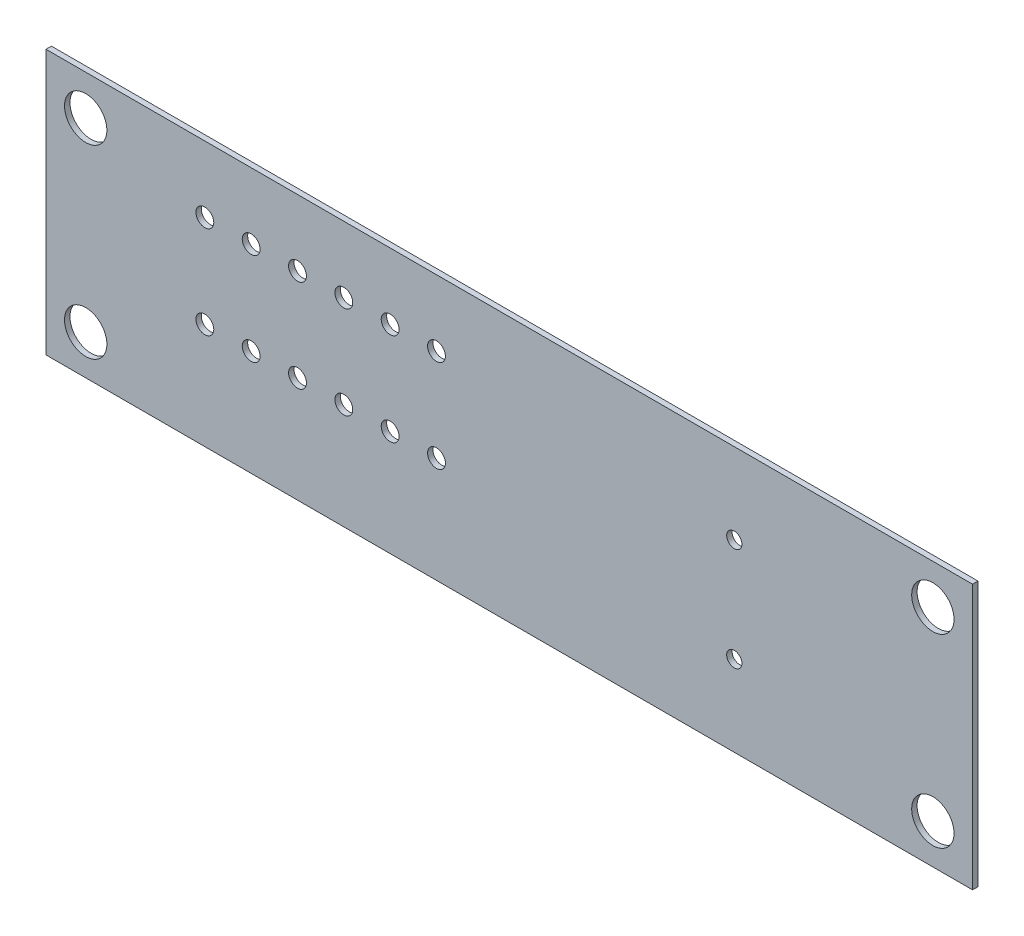
ISO-10303-21;
HEADER;
FILE_DESCRIPTION(('STEP AP214'),'2;1');
FILE_NAME('part.step','',(''),(''),'','','');
FILE_SCHEMA(('AUTOMOTIVE_DESIGN { 1 0 10303 214 1 1 1 1 }'));
ENDSEC;
DATA;
#1=APPLICATION_CONTEXT('core data for automotive mechanical design processes');
#2=APPLICATION_PROTOCOL_DEFINITION('international standard','automotive_design',2000,#1);
#3=PRODUCT_CONTEXT('',#1,'mechanical');
#4=PRODUCT('Part','Part','',(#3));
#5=PRODUCT_RELATED_PRODUCT_CATEGORY('part','',(#4));
#6=PRODUCT_DEFINITION_FORMATION('','',#4);
#7=PRODUCT_DEFINITION_CONTEXT('part definition',#1,'design');
#8=PRODUCT_DEFINITION('design','',#6,#7);
#9=PRODUCT_DEFINITION_SHAPE('','',#8);
#10=(LENGTH_UNIT() NAMED_UNIT(*) SI_UNIT(.MILLI.,.METRE.));
#11=(NAMED_UNIT(*) PLANE_ANGLE_UNIT() SI_UNIT($,.RADIAN.));
#12=(NAMED_UNIT(*) SI_UNIT($,.STERADIAN.) SOLID_ANGLE_UNIT());
#13=UNCERTAINTY_MEASURE_WITH_UNIT(LENGTH_MEASURE(1.E-05),#10,'distance_accuracy_value','');
#14=(GEOMETRIC_REPRESENTATION_CONTEXT(3) GLOBAL_UNCERTAINTY_ASSIGNED_CONTEXT((#13)) GLOBAL_UNIT_ASSIGNED_CONTEXT((#10,
#11,#12)) REPRESENTATION_CONTEXT('',''));
#15=CARTESIAN_POINT('',(0.,0.,0.));
#16=DIRECTION('',(0.,0.,1.));
#17=DIRECTION('',(1.,0.,0.));
#18=AXIS2_PLACEMENT_3D('',#15,#16,#17);
#19=CARTESIAN_POINT('',(70.,0.,0.41148));
#20=DIRECTION('',(0.,1.,0.));
#21=DIRECTION('',(0.,0.,1.));
#22=AXIS2_PLACEMENT_3D('',#19,#20,#21);
#23=PLANE('',#22);
#24=DIRECTION('',(1.,0.,0.));
#25=VECTOR('',#24,1.);
#26=CARTESIAN_POINT('',(70.,0.,0.));
#27=LINE('',#26,#25);
#28=CARTESIAN_POINT('',(0.,0.,0.));
#29=VERTEX_POINT('',#28);
#30=CARTESIAN_POINT('',(70.,0.,0.));
#31=VERTEX_POINT('',#30);
#32=EDGE_CURVE('E114',#29,#31,#27,.T.);
#33=ORIENTED_EDGE('',*,*,#32,.T.);
#34=DIRECTION('',(0.,0.,-1.));
#35=VECTOR('',#34,1.);
#36=CARTESIAN_POINT('',(70.,0.,0.41148));
#37=LINE('',#36,#35);
#38=CARTESIAN_POINT('',(70.,0.,0.41148));
#39=VERTEX_POINT('',#38);
#40=EDGE_CURVE('E11',#39,#31,#37,.T.);
#41=ORIENTED_EDGE('',*,*,#40,.F.);
#42=DIRECTION('',(1.,0.,0.));
#43=VECTOR('',#42,1.);
#44=CARTESIAN_POINT('',(70.,0.,0.41148));
#45=LINE('',#44,#43);
#46=CARTESIAN_POINT('',(0.,0.,0.41148));
#47=VERTEX_POINT('',#46);
#48=EDGE_CURVE('E98',#47,#39,#45,.T.);
#49=ORIENTED_EDGE('',*,*,#48,.F.);
#50=DIRECTION('',(0.,0.,-1.));
#51=VECTOR('',#50,1.);
#52=CARTESIAN_POINT('',(0.,0.,0.41148));
#53=LINE('',#52,#51);
#54=EDGE_CURVE('E110',#47,#29,#53,.T.);
#55=ORIENTED_EDGE('',*,*,#54,.T.);
#56=EDGE_LOOP('',(#33,#41,#49,#55));
#57=FACE_BOUND('',#56,.T.);
#58=ADVANCED_FACE('F46',(#57),#23,.F.);
#59=CARTESIAN_POINT('',(70.,20.,0.41148));
#60=DIRECTION('',(-1.,0.,0.));
#61=DIRECTION('',(0.,0.,1.));
#62=AXIS2_PLACEMENT_3D('',#59,#60,#61);
#63=PLANE('',#62);
#64=DIRECTION('',(0.,1.,0.));
#65=VECTOR('',#64,1.);
#66=CARTESIAN_POINT('',(70.,20.,0.));
#67=LINE('',#66,#65);
#68=CARTESIAN_POINT('',(70.,20.,0.));
#69=VERTEX_POINT('',#68);
#70=EDGE_CURVE('E103',#31,#69,#67,.T.);
#71=ORIENTED_EDGE('',*,*,#70,.T.);
#72=DIRECTION('',(0.,0.,-1.));
#73=VECTOR('',#72,1.);
#74=CARTESIAN_POINT('',(70.,20.,0.41148));
#75=LINE('',#74,#73);
#76=CARTESIAN_POINT('',(70.,20.,0.41148));
#77=VERTEX_POINT('',#76);
#78=EDGE_CURVE('E55',#77,#69,#75,.T.);
#79=ORIENTED_EDGE('',*,*,#78,.F.);
#80=DIRECTION('',(0.,1.,0.));
#81=VECTOR('',#80,1.);
#82=CARTESIAN_POINT('',(70.,20.,0.41148));
#83=LINE('',#82,#81);
#84=EDGE_CURVE('E93',#39,#77,#83,.T.);
#85=ORIENTED_EDGE('',*,*,#84,.F.);
#86=ORIENTED_EDGE('',*,*,#40,.T.);
#87=EDGE_LOOP('',(#71,#79,#85,#86));
#88=FACE_BOUND('',#87,.T.);
#89=ADVANCED_FACE('F102',(#88),#63,.F.);
#90=CARTESIAN_POINT('',(0.,20.,0.41148));
#91=DIRECTION('',(0.,-1.,0.));
#92=DIRECTION('',(0.,0.,-1.));
#93=AXIS2_PLACEMENT_3D('',#90,#91,#92);
#94=PLANE('',#93);
#95=DIRECTION('',(-1.,0.,0.));
#96=VECTOR('',#95,1.);
#97=CARTESIAN_POINT('',(0.,20.,0.));
#98=LINE('',#97,#96);
#99=CARTESIAN_POINT('',(0.,20.,0.));
#100=VERTEX_POINT('',#99);
#101=EDGE_CURVE('E80',#69,#100,#98,.T.);
#102=ORIENTED_EDGE('',*,*,#101,.T.);
#103=DIRECTION('',(0.,0.,-1.));
#104=VECTOR('',#103,1.);
#105=CARTESIAN_POINT('',(0.,20.,0.41148));
#106=LINE('',#105,#104);
#107=CARTESIAN_POINT('',(0.,20.,0.41148));
#108=VERTEX_POINT('',#107);
#109=EDGE_CURVE('E105',#108,#100,#106,.T.);
#110=ORIENTED_EDGE('',*,*,#109,.F.);
#111=DIRECTION('',(-1.,0.,0.));
#112=VECTOR('',#111,1.);
#113=CARTESIAN_POINT('',(0.,20.,0.41148));
#114=LINE('',#113,#112);
#115=EDGE_CURVE('E96',#77,#108,#114,.T.);
#116=ORIENTED_EDGE('',*,*,#115,.F.);
#117=ORIENTED_EDGE('',*,*,#78,.T.);
#118=EDGE_LOOP('',(#102,#110,#116,#117));
#119=FACE_BOUND('',#118,.T.);
#120=ADVANCED_FACE('F106',(#119),#94,.F.);
#121=CARTESIAN_POINT('',(0.,0.,0.41148));
#122=DIRECTION('',(1.,0.,0.));
#123=DIRECTION('',(0.,0.,-1.));
#124=AXIS2_PLACEMENT_3D('',#121,#122,#123);
#125=PLANE('',#124);
#126=DIRECTION('',(0.,-1.,0.));
#127=VECTOR('',#126,1.);
#128=CARTESIAN_POINT('',(0.,0.,0.));
#129=LINE('',#128,#127);
#130=EDGE_CURVE('E86',#100,#29,#129,.T.);
#131=ORIENTED_EDGE('',*,*,#130,.T.);
#132=ORIENTED_EDGE('',*,*,#54,.F.);
#133=DIRECTION('',(0.,-1.,0.));
#134=VECTOR('',#133,1.);
#135=CARTESIAN_POINT('',(0.,0.,0.41148));
#136=LINE('',#135,#134);
#137=EDGE_CURVE('E63',#108,#47,#136,.T.);
#138=ORIENTED_EDGE('',*,*,#137,.F.);
#139=ORIENTED_EDGE('',*,*,#109,.T.);
#140=EDGE_LOOP('',(#131,#132,#138,#139));
#141=FACE_BOUND('',#140,.T.);
#142=ADVANCED_FACE('F128',(#141),#125,.F.);
#143=CARTESIAN_POINT('',(0.,0.,0.41148));
#144=DIRECTION('',(0.,0.,-1.));
#145=DIRECTION('',(-1.,0.,0.));
#146=AXIS2_PLACEMENT_3D('',#143,#144,#145);
#147=PLANE('',#146);
#148=CARTESIAN_POINT('',(3.,3.,0.411480000000006));
#149=DIRECTION('',(0.,0.,-1.));
#150=DIRECTION('',(-1.,0.,0.));
#151=AXIS2_PLACEMENT_3D('',#148,#149,#150);
#152=CIRCLE('',#151,1.59999999999999);
#153=CARTESIAN_POINT('',(1.40000000000001,3.,0.411480000000006));
#154=VERTEX_POINT('',#153);
#155=EDGE_CURVE('E270',#154,#154,#152,.T.);
#156=ORIENTED_EDGE('',*,*,#155,.T.);
#157=EDGE_LOOP('',(#156));
#158=FACE_BOUND('',#157,.T.);
#159=CARTESIAN_POINT('',(3.,17.,0.411480000000006));
#160=DIRECTION('',(0.,0.,-1.));
#161=DIRECTION('',(-1.,0.,0.));
#162=AXIS2_PLACEMENT_3D('',#159,#160,#161);
#163=CIRCLE('',#162,1.59999999999999);
#164=CARTESIAN_POINT('',(1.40000000000001,17.,0.411480000000006));
#165=VERTEX_POINT('',#164);
#166=EDGE_CURVE('E262',#165,#165,#163,.T.);
#167=ORIENTED_EDGE('',*,*,#166,.T.);
#168=EDGE_LOOP('',(#167));
#169=FACE_BOUND('',#168,.T.);
#170=CARTESIAN_POINT('',(67.,17.,0.411480000000006));
#171=DIRECTION('',(0.,0.,-1.));
#172=DIRECTION('',(-1.,0.,0.));
#173=AXIS2_PLACEMENT_3D('',#170,#171,#172);
#174=CIRCLE('',#173,1.59999999999999);
#175=CARTESIAN_POINT('',(65.4,17.,0.411480000000006));
#176=VERTEX_POINT('',#175);
#177=EDGE_CURVE('E254',#176,#176,#174,.T.);
#178=ORIENTED_EDGE('',*,*,#177,.T.);
#179=EDGE_LOOP('',(#178));
#180=FACE_BOUND('',#179,.T.);
#181=CARTESIAN_POINT('',(67.,3.,0.411480000000006));
#182=DIRECTION('',(0.,0.,-1.));
#183=DIRECTION('',(-1.,0.,0.));
#184=AXIS2_PLACEMENT_3D('',#181,#182,#183);
#185=CIRCLE('',#184,1.59999999999999);
#186=CARTESIAN_POINT('',(65.4,3.,0.411480000000006));
#187=VERTEX_POINT('',#186);
#188=EDGE_CURVE('E246',#187,#187,#185,.T.);
#189=ORIENTED_EDGE('',*,*,#188,.T.);
#190=EDGE_LOOP('',(#189));
#191=FACE_BOUND('',#190,.T.);
#192=CARTESIAN_POINT('',(52.,13.9,0.411480000000006));
#193=DIRECTION('',(0.,0.,-1.));
#194=DIRECTION('',(-1.,0.,0.));
#195=AXIS2_PLACEMENT_3D('',#192,#193,#194);
#196=CIRCLE('',#195,0.574999999999985);
#197=CARTESIAN_POINT('',(51.425,13.9,0.411480000000006));
#198=VERTEX_POINT('',#197);
#199=EDGE_CURVE('E238',#198,#198,#196,.T.);
#200=ORIENTED_EDGE('',*,*,#199,.T.);
#201=EDGE_LOOP('',(#200));
#202=FACE_BOUND('',#201,.T.);
#203=CARTESIAN_POINT('',(52.,6.1,0.411480000000006));
#204=DIRECTION('',(0.,0.,-1.));
#205=DIRECTION('',(-1.,0.,0.));
#206=AXIS2_PLACEMENT_3D('',#203,#204,#205);
#207=CIRCLE('',#206,0.574999999999985);
#208=CARTESIAN_POINT('',(51.425,6.1,0.411480000000006));
#209=VERTEX_POINT('',#208);
#210=EDGE_CURVE('E230',#209,#209,#207,.T.);
#211=ORIENTED_EDGE('',*,*,#210,.T.);
#212=EDGE_LOOP('',(#211));
#213=FACE_BOUND('',#212,.T.);
#214=CARTESIAN_POINT('',(12.,8.,0.411480000000006));
#215=DIRECTION('',(0.,0.,-1.));
#216=DIRECTION('',(-1.,0.,0.));
#217=AXIS2_PLACEMENT_3D('',#214,#215,#216);
#218=CIRCLE('',#217,0.674999999999988);
#219=CARTESIAN_POINT('',(11.325,8.,0.411480000000006));
#220=VERTEX_POINT('',#219);
#221=EDGE_CURVE('E222',#220,#220,#218,.T.);
#222=ORIENTED_EDGE('',*,*,#221,.T.);
#223=EDGE_LOOP('',(#222));
#224=FACE_BOUND('',#223,.T.);
#225=CARTESIAN_POINT('',(12.,15.,0.411480000000006));
#226=DIRECTION('',(0.,0.,-1.));
#227=DIRECTION('',(-1.,0.,0.));
#228=AXIS2_PLACEMENT_3D('',#225,#226,#227);
#229=CIRCLE('',#228,0.674999999999988);
#230=CARTESIAN_POINT('',(11.325,15.,0.411480000000006));
#231=VERTEX_POINT('',#230);
#232=EDGE_CURVE('E214',#231,#231,#229,.T.);
#233=ORIENTED_EDGE('',*,*,#232,.T.);
#234=EDGE_LOOP('',(#233));
#235=FACE_BOUND('',#234,.T.);
#236=CARTESIAN_POINT('',(15.5,8.,0.411480000000006));
#237=DIRECTION('',(0.,0.,-1.));
#238=DIRECTION('',(-1.,0.,0.));
#239=AXIS2_PLACEMENT_3D('',#236,#237,#238);
#240=CIRCLE('',#239,0.674999999999988);
#241=CARTESIAN_POINT('',(14.825,8.,0.411480000000006));
#242=VERTEX_POINT('',#241);
#243=EDGE_CURVE('E206',#242,#242,#240,.T.);
#244=ORIENTED_EDGE('',*,*,#243,.T.);
#245=EDGE_LOOP('',(#244));
#246=FACE_BOUND('',#245,.T.);
#247=CARTESIAN_POINT('',(15.5,15.,0.411480000000006));
#248=DIRECTION('',(0.,0.,-1.));
#249=DIRECTION('',(-1.,0.,0.));
#250=AXIS2_PLACEMENT_3D('',#247,#248,#249);
#251=CIRCLE('',#250,0.674999999999988);
#252=CARTESIAN_POINT('',(14.825,15.,0.411480000000006));
#253=VERTEX_POINT('',#252);
#254=EDGE_CURVE('E198',#253,#253,#251,.T.);
#255=ORIENTED_EDGE('',*,*,#254,.T.);
#256=EDGE_LOOP('',(#255));
#257=FACE_BOUND('',#256,.T.);
#258=CARTESIAN_POINT('',(19.,8.,0.411480000000006));
#259=DIRECTION('',(0.,0.,-1.));
#260=DIRECTION('',(-1.,0.,0.));
#261=AXIS2_PLACEMENT_3D('',#258,#259,#260);
#262=CIRCLE('',#261,0.674999999999988);
#263=CARTESIAN_POINT('',(18.325,8.,0.411480000000006));
#264=VERTEX_POINT('',#263);
#265=EDGE_CURVE('E190',#264,#264,#262,.T.);
#266=ORIENTED_EDGE('',*,*,#265,.T.);
#267=EDGE_LOOP('',(#266));
#268=FACE_BOUND('',#267,.T.);
#269=CARTESIAN_POINT('',(19.,15.,0.411480000000006));
#270=DIRECTION('',(0.,0.,-1.));
#271=DIRECTION('',(-1.,0.,0.));
#272=AXIS2_PLACEMENT_3D('',#269,#270,#271);
#273=CIRCLE('',#272,0.674999999999988);
#274=CARTESIAN_POINT('',(18.325,15.,0.411480000000006));
#275=VERTEX_POINT('',#274);
#276=EDGE_CURVE('E182',#275,#275,#273,.T.);
#277=ORIENTED_EDGE('',*,*,#276,.T.);
#278=EDGE_LOOP('',(#277));
#279=FACE_BOUND('',#278,.T.);
#280=CARTESIAN_POINT('',(22.5,8.,0.411480000000006));
#281=DIRECTION('',(0.,0.,-1.));
#282=DIRECTION('',(-1.,0.,0.));
#283=AXIS2_PLACEMENT_3D('',#280,#281,#282);
#284=CIRCLE('',#283,0.674999999999988);
#285=CARTESIAN_POINT('',(21.825,8.,0.411480000000006));
#286=VERTEX_POINT('',#285);
#287=EDGE_CURVE('E174',#286,#286,#284,.T.);
#288=ORIENTED_EDGE('',*,*,#287,.T.);
#289=EDGE_LOOP('',(#288));
#290=FACE_BOUND('',#289,.T.);
#291=CARTESIAN_POINT('',(22.5,15.,0.411480000000006));
#292=DIRECTION('',(0.,0.,-1.));
#293=DIRECTION('',(-1.,0.,0.));
#294=AXIS2_PLACEMENT_3D('',#291,#292,#293);
#295=CIRCLE('',#294,0.674999999999988);
#296=CARTESIAN_POINT('',(21.825,15.,0.411480000000006));
#297=VERTEX_POINT('',#296);
#298=EDGE_CURVE('E166',#297,#297,#295,.T.);
#299=ORIENTED_EDGE('',*,*,#298,.T.);
#300=EDGE_LOOP('',(#299));
#301=FACE_BOUND('',#300,.T.);
#302=CARTESIAN_POINT('',(26.,8.,0.411480000000006));
#303=DIRECTION('',(0.,0.,-1.));
#304=DIRECTION('',(-1.,0.,0.));
#305=AXIS2_PLACEMENT_3D('',#302,#303,#304);
#306=CIRCLE('',#305,0.674999999999988);
#307=CARTESIAN_POINT('',(25.325,8.,0.411480000000006));
#308=VERTEX_POINT('',#307);
#309=EDGE_CURVE('E158',#308,#308,#306,.T.);
#310=ORIENTED_EDGE('',*,*,#309,.T.);
#311=EDGE_LOOP('',(#310));
#312=FACE_BOUND('',#311,.T.);
#313=CARTESIAN_POINT('',(26.,15.,0.411480000000006));
#314=DIRECTION('',(0.,0.,-1.));
#315=DIRECTION('',(-1.,0.,0.));
#316=AXIS2_PLACEMENT_3D('',#313,#314,#315);
#317=CIRCLE('',#316,0.674999999999988);
#318=CARTESIAN_POINT('',(25.325,15.,0.411480000000006));
#319=VERTEX_POINT('',#318);
#320=EDGE_CURVE('E150',#319,#319,#317,.T.);
#321=ORIENTED_EDGE('',*,*,#320,.T.);
#322=EDGE_LOOP('',(#321));
#323=FACE_BOUND('',#322,.T.);
#324=CARTESIAN_POINT('',(29.5,8.,0.411480000000006));
#325=DIRECTION('',(0.,0.,-1.));
#326=DIRECTION('',(-1.,0.,0.));
#327=AXIS2_PLACEMENT_3D('',#324,#325,#326);
#328=CIRCLE('',#327,0.674999999999988);
#329=CARTESIAN_POINT('',(28.825,8.,0.411480000000006));
#330=VERTEX_POINT('',#329);
#331=EDGE_CURVE('E142',#330,#330,#328,.T.);
#332=ORIENTED_EDGE('',*,*,#331,.T.);
#333=EDGE_LOOP('',(#332));
#334=FACE_BOUND('',#333,.T.);
#335=CARTESIAN_POINT('',(29.5,15.,0.411480000000006));
#336=DIRECTION('',(0.,0.,-1.));
#337=DIRECTION('',(-1.,0.,0.));
#338=AXIS2_PLACEMENT_3D('',#335,#336,#337);
#339=CIRCLE('',#338,0.674999999999988);
#340=CARTESIAN_POINT('',(28.825,15.,0.411480000000006));
#341=VERTEX_POINT('',#340);
#342=EDGE_CURVE('E118',#341,#341,#339,.T.);
#343=ORIENTED_EDGE('',*,*,#342,.T.);
#344=EDGE_LOOP('',(#343));
#345=FACE_BOUND('',#344,.T.);
#346=ORIENTED_EDGE('',*,*,#48,.T.);
#347=ORIENTED_EDGE('',*,*,#84,.T.);
#348=ORIENTED_EDGE('',*,*,#115,.T.);
#349=ORIENTED_EDGE('',*,*,#137,.T.);
#350=EDGE_LOOP('',(#346,#347,#348,#349));
#351=FACE_BOUND('',#350,.T.);
#352=ADVANCED_FACE('F94',(#158,#169,#180,#191,#202,#213,#224,#235,#246,#257,#268,#279,#290,#301,
#312,#323,#334,#345,#351),#147,.F.);
#353=CARTESIAN_POINT('',(0.,0.,0.));
#354=DIRECTION('',(0.,0.,-1.));
#355=DIRECTION('',(-1.,0.,0.));
#356=AXIS2_PLACEMENT_3D('',#353,#354,#355);
#357=PLANE('',#356);
#358=CARTESIAN_POINT('',(3.,3.,0.));
#359=DIRECTION('',(0.,0.,-1.));
#360=DIRECTION('',(-1.,0.,0.));
#361=AXIS2_PLACEMENT_3D('',#358,#359,#360);
#362=CIRCLE('',#361,1.59999999999999);
#363=CARTESIAN_POINT('',(1.40000000000001,3.,0.));
#364=VERTEX_POINT('',#363);
#365=EDGE_CURVE('E274',#364,#364,#362,.T.);
#366=ORIENTED_EDGE('',*,*,#365,.F.);
#367=EDGE_LOOP('',(#366));
#368=FACE_BOUND('',#367,.T.);
#369=CARTESIAN_POINT('',(3.,17.,0.));
#370=DIRECTION('',(0.,0.,-1.));
#371=DIRECTION('',(-1.,0.,0.));
#372=AXIS2_PLACEMENT_3D('',#369,#370,#371);
#373=CIRCLE('',#372,1.59999999999999);
#374=CARTESIAN_POINT('',(1.40000000000001,17.,0.));
#375=VERTEX_POINT('',#374);
#376=EDGE_CURVE('E266',#375,#375,#373,.T.);
#377=ORIENTED_EDGE('',*,*,#376,.F.);
#378=EDGE_LOOP('',(#377));
#379=FACE_BOUND('',#378,.T.);
#380=CARTESIAN_POINT('',(67.,17.,0.));
#381=DIRECTION('',(0.,0.,-1.));
#382=DIRECTION('',(-1.,0.,0.));
#383=AXIS2_PLACEMENT_3D('',#380,#381,#382);
#384=CIRCLE('',#383,1.59999999999999);
#385=CARTESIAN_POINT('',(65.4,17.,0.));
#386=VERTEX_POINT('',#385);
#387=EDGE_CURVE('E258',#386,#386,#384,.T.);
#388=ORIENTED_EDGE('',*,*,#387,.F.);
#389=EDGE_LOOP('',(#388));
#390=FACE_BOUND('',#389,.T.);
#391=CARTESIAN_POINT('',(67.,3.,0.));
#392=DIRECTION('',(0.,0.,-1.));
#393=DIRECTION('',(-1.,0.,0.));
#394=AXIS2_PLACEMENT_3D('',#391,#392,#393);
#395=CIRCLE('',#394,1.59999999999999);
#396=CARTESIAN_POINT('',(65.4,3.,0.));
#397=VERTEX_POINT('',#396);
#398=EDGE_CURVE('E250',#397,#397,#395,.T.);
#399=ORIENTED_EDGE('',*,*,#398,.F.);
#400=EDGE_LOOP('',(#399));
#401=FACE_BOUND('',#400,.T.);
#402=CARTESIAN_POINT('',(52.,13.9,0.));
#403=DIRECTION('',(0.,0.,-1.));
#404=DIRECTION('',(-1.,0.,0.));
#405=AXIS2_PLACEMENT_3D('',#402,#403,#404);
#406=CIRCLE('',#405,0.574999999999985);
#407=CARTESIAN_POINT('',(51.425,13.9,0.));
#408=VERTEX_POINT('',#407);
#409=EDGE_CURVE('E242',#408,#408,#406,.T.);
#410=ORIENTED_EDGE('',*,*,#409,.F.);
#411=EDGE_LOOP('',(#410));
#412=FACE_BOUND('',#411,.T.);
#413=CARTESIAN_POINT('',(52.,6.1,0.));
#414=DIRECTION('',(0.,0.,-1.));
#415=DIRECTION('',(-1.,0.,0.));
#416=AXIS2_PLACEMENT_3D('',#413,#414,#415);
#417=CIRCLE('',#416,0.574999999999985);
#418=CARTESIAN_POINT('',(51.425,6.1,0.));
#419=VERTEX_POINT('',#418);
#420=EDGE_CURVE('E234',#419,#419,#417,.T.);
#421=ORIENTED_EDGE('',*,*,#420,.F.);
#422=EDGE_LOOP('',(#421));
#423=FACE_BOUND('',#422,.T.);
#424=CARTESIAN_POINT('',(12.,8.,0.));
#425=DIRECTION('',(0.,0.,-1.));
#426=DIRECTION('',(-1.,0.,0.));
#427=AXIS2_PLACEMENT_3D('',#424,#425,#426);
#428=CIRCLE('',#427,0.674999999999988);
#429=CARTESIAN_POINT('',(11.325,8.,0.));
#430=VERTEX_POINT('',#429);
#431=EDGE_CURVE('E226',#430,#430,#428,.T.);
#432=ORIENTED_EDGE('',*,*,#431,.F.);
#433=EDGE_LOOP('',(#432));
#434=FACE_BOUND('',#433,.T.);
#435=CARTESIAN_POINT('',(12.,15.,0.));
#436=DIRECTION('',(0.,0.,-1.));
#437=DIRECTION('',(-1.,0.,0.));
#438=AXIS2_PLACEMENT_3D('',#435,#436,#437);
#439=CIRCLE('',#438,0.674999999999988);
#440=CARTESIAN_POINT('',(11.325,15.,0.));
#441=VERTEX_POINT('',#440);
#442=EDGE_CURVE('E218',#441,#441,#439,.T.);
#443=ORIENTED_EDGE('',*,*,#442,.F.);
#444=EDGE_LOOP('',(#443));
#445=FACE_BOUND('',#444,.T.);
#446=CARTESIAN_POINT('',(15.5,8.,0.));
#447=DIRECTION('',(0.,0.,-1.));
#448=DIRECTION('',(-1.,0.,0.));
#449=AXIS2_PLACEMENT_3D('',#446,#447,#448);
#450=CIRCLE('',#449,0.674999999999988);
#451=CARTESIAN_POINT('',(14.825,8.,0.));
#452=VERTEX_POINT('',#451);
#453=EDGE_CURVE('E210',#452,#452,#450,.T.);
#454=ORIENTED_EDGE('',*,*,#453,.F.);
#455=EDGE_LOOP('',(#454));
#456=FACE_BOUND('',#455,.T.);
#457=CARTESIAN_POINT('',(15.5,15.,0.));
#458=DIRECTION('',(0.,0.,-1.));
#459=DIRECTION('',(-1.,0.,0.));
#460=AXIS2_PLACEMENT_3D('',#457,#458,#459);
#461=CIRCLE('',#460,0.674999999999988);
#462=CARTESIAN_POINT('',(14.825,15.,0.));
#463=VERTEX_POINT('',#462);
#464=EDGE_CURVE('E202',#463,#463,#461,.T.);
#465=ORIENTED_EDGE('',*,*,#464,.F.);
#466=EDGE_LOOP('',(#465));
#467=FACE_BOUND('',#466,.T.);
#468=CARTESIAN_POINT('',(19.,8.,0.));
#469=DIRECTION('',(0.,0.,-1.));
#470=DIRECTION('',(-1.,0.,0.));
#471=AXIS2_PLACEMENT_3D('',#468,#469,#470);
#472=CIRCLE('',#471,0.674999999999988);
#473=CARTESIAN_POINT('',(18.325,8.,0.));
#474=VERTEX_POINT('',#473);
#475=EDGE_CURVE('E194',#474,#474,#472,.T.);
#476=ORIENTED_EDGE('',*,*,#475,.F.);
#477=EDGE_LOOP('',(#476));
#478=FACE_BOUND('',#477,.T.);
#479=CARTESIAN_POINT('',(19.,15.,0.));
#480=DIRECTION('',(0.,0.,-1.));
#481=DIRECTION('',(-1.,0.,0.));
#482=AXIS2_PLACEMENT_3D('',#479,#480,#481);
#483=CIRCLE('',#482,0.674999999999988);
#484=CARTESIAN_POINT('',(18.325,15.,0.));
#485=VERTEX_POINT('',#484);
#486=EDGE_CURVE('E186',#485,#485,#483,.T.);
#487=ORIENTED_EDGE('',*,*,#486,.F.);
#488=EDGE_LOOP('',(#487));
#489=FACE_BOUND('',#488,.T.);
#490=CARTESIAN_POINT('',(22.5,8.,0.));
#491=DIRECTION('',(0.,0.,-1.));
#492=DIRECTION('',(-1.,0.,0.));
#493=AXIS2_PLACEMENT_3D('',#490,#491,#492);
#494=CIRCLE('',#493,0.674999999999988);
#495=CARTESIAN_POINT('',(21.825,8.,0.));
#496=VERTEX_POINT('',#495);
#497=EDGE_CURVE('E178',#496,#496,#494,.T.);
#498=ORIENTED_EDGE('',*,*,#497,.F.);
#499=EDGE_LOOP('',(#498));
#500=FACE_BOUND('',#499,.T.);
#501=CARTESIAN_POINT('',(22.5,15.,0.));
#502=DIRECTION('',(0.,0.,-1.));
#503=DIRECTION('',(-1.,0.,0.));
#504=AXIS2_PLACEMENT_3D('',#501,#502,#503);
#505=CIRCLE('',#504,0.674999999999988);
#506=CARTESIAN_POINT('',(21.825,15.,0.));
#507=VERTEX_POINT('',#506);
#508=EDGE_CURVE('E170',#507,#507,#505,.T.);
#509=ORIENTED_EDGE('',*,*,#508,.F.);
#510=EDGE_LOOP('',(#509));
#511=FACE_BOUND('',#510,.T.);
#512=CARTESIAN_POINT('',(26.,8.,0.));
#513=DIRECTION('',(0.,0.,-1.));
#514=DIRECTION('',(-1.,0.,0.));
#515=AXIS2_PLACEMENT_3D('',#512,#513,#514);
#516=CIRCLE('',#515,0.674999999999988);
#517=CARTESIAN_POINT('',(25.325,8.,0.));
#518=VERTEX_POINT('',#517);
#519=EDGE_CURVE('E162',#518,#518,#516,.T.);
#520=ORIENTED_EDGE('',*,*,#519,.F.);
#521=EDGE_LOOP('',(#520));
#522=FACE_BOUND('',#521,.T.);
#523=CARTESIAN_POINT('',(26.,15.,0.));
#524=DIRECTION('',(0.,0.,-1.));
#525=DIRECTION('',(-1.,0.,0.));
#526=AXIS2_PLACEMENT_3D('',#523,#524,#525);
#527=CIRCLE('',#526,0.674999999999988);
#528=CARTESIAN_POINT('',(25.325,15.,0.));
#529=VERTEX_POINT('',#528);
#530=EDGE_CURVE('E154',#529,#529,#527,.T.);
#531=ORIENTED_EDGE('',*,*,#530,.F.);
#532=EDGE_LOOP('',(#531));
#533=FACE_BOUND('',#532,.T.);
#534=CARTESIAN_POINT('',(29.5,8.,0.));
#535=DIRECTION('',(0.,0.,-1.));
#536=DIRECTION('',(-1.,0.,0.));
#537=AXIS2_PLACEMENT_3D('',#534,#535,#536);
#538=CIRCLE('',#537,0.674999999999988);
#539=CARTESIAN_POINT('',(28.825,8.,0.));
#540=VERTEX_POINT('',#539);
#541=EDGE_CURVE('E146',#540,#540,#538,.T.);
#542=ORIENTED_EDGE('',*,*,#541,.F.);
#543=EDGE_LOOP('',(#542));
#544=FACE_BOUND('',#543,.T.);
#545=CARTESIAN_POINT('',(29.5,15.,0.));
#546=DIRECTION('',(0.,0.,-1.));
#547=DIRECTION('',(-1.,0.,0.));
#548=AXIS2_PLACEMENT_3D('',#545,#546,#547);
#549=CIRCLE('',#548,0.674999999999988);
#550=CARTESIAN_POINT('',(28.825,15.,0.));
#551=VERTEX_POINT('',#550);
#552=EDGE_CURVE('E138',#551,#551,#549,.T.);
#553=ORIENTED_EDGE('',*,*,#552,.F.);
#554=EDGE_LOOP('',(#553));
#555=FACE_BOUND('',#554,.T.);
#556=ORIENTED_EDGE('',*,*,#32,.F.);
#557=ORIENTED_EDGE('',*,*,#130,.F.);
#558=ORIENTED_EDGE('',*,*,#101,.F.);
#559=ORIENTED_EDGE('',*,*,#70,.F.);
#560=EDGE_LOOP('',(#556,#557,#558,#559));
#561=FACE_BOUND('',#560,.T.);
#562=ADVANCED_FACE('F131',(#368,#379,#390,#401,#412,#423,#434,#445,#456,#467,#478,#489,#500,
#511,#522,#533,#544,#555,#561),#357,.T.);
#563=CARTESIAN_POINT('',(29.5,15.,0.));
#564=DIRECTION('',(0.,0.,-1.));
#565=DIRECTION('',(-1.,0.,0.));
#566=AXIS2_PLACEMENT_3D('',#563,#564,#565);
#567=CYLINDRICAL_SURFACE('',#566,0.674999999999988);
#568=ORIENTED_EDGE('',*,*,#342,.F.);
#569=EDGE_LOOP('',(#568));
#570=FACE_BOUND('',#569,.T.);
#571=ORIENTED_EDGE('',*,*,#552,.T.);
#572=EDGE_LOOP('',(#571));
#573=FACE_BOUND('',#572,.T.);
#574=ADVANCED_FACE('F283',(#570,#573),#567,.F.);
#575=CARTESIAN_POINT('',(29.5,8.,0.));
#576=DIRECTION('',(0.,0.,-1.));
#577=DIRECTION('',(-1.,0.,0.));
#578=AXIS2_PLACEMENT_3D('',#575,#576,#577);
#579=CYLINDRICAL_SURFACE('',#578,0.674999999999988);
#580=ORIENTED_EDGE('',*,*,#331,.F.);
#581=EDGE_LOOP('',(#580));
#582=FACE_BOUND('',#581,.T.);
#583=ORIENTED_EDGE('',*,*,#541,.T.);
#584=EDGE_LOOP('',(#583));
#585=FACE_BOUND('',#584,.T.);
#586=ADVANCED_FACE('F320',(#582,#585),#579,.F.);
#587=CARTESIAN_POINT('',(26.,15.,0.));
#588=DIRECTION('',(0.,0.,-1.));
#589=DIRECTION('',(-1.,0.,0.));
#590=AXIS2_PLACEMENT_3D('',#587,#588,#589);
#591=CYLINDRICAL_SURFACE('',#590,0.674999999999988);
#592=ORIENTED_EDGE('',*,*,#320,.F.);
#593=EDGE_LOOP('',(#592));
#594=FACE_BOUND('',#593,.T.);
#595=ORIENTED_EDGE('',*,*,#530,.T.);
#596=EDGE_LOOP('',(#595));
#597=FACE_BOUND('',#596,.T.);
#598=ADVANCED_FACE('F326',(#594,#597),#591,.F.);
#599=CARTESIAN_POINT('',(26.,8.,0.));
#600=DIRECTION('',(0.,0.,-1.));
#601=DIRECTION('',(-1.,0.,0.));
#602=AXIS2_PLACEMENT_3D('',#599,#600,#601);
#603=CYLINDRICAL_SURFACE('',#602,0.674999999999988);
#604=ORIENTED_EDGE('',*,*,#309,.F.);
#605=EDGE_LOOP('',(#604));
#606=FACE_BOUND('',#605,.T.);
#607=ORIENTED_EDGE('',*,*,#519,.T.);
#608=EDGE_LOOP('',(#607));
#609=FACE_BOUND('',#608,.T.);
#610=ADVANCED_FACE('F383',(#606,#609),#603,.F.);
#611=CARTESIAN_POINT('',(22.5,15.,0.));
#612=DIRECTION('',(0.,0.,-1.));
#613=DIRECTION('',(-1.,0.,0.));
#614=AXIS2_PLACEMENT_3D('',#611,#612,#613);
#615=CYLINDRICAL_SURFACE('',#614,0.674999999999988);
#616=ORIENTED_EDGE('',*,*,#298,.F.);
#617=EDGE_LOOP('',(#616));
#618=FACE_BOUND('',#617,.T.);
#619=ORIENTED_EDGE('',*,*,#508,.T.);
#620=EDGE_LOOP('',(#619));
#621=FACE_BOUND('',#620,.T.);
#622=ADVANCED_FACE('F388',(#618,#621),#615,.F.);
#623=CARTESIAN_POINT('',(22.5,8.,0.));
#624=DIRECTION('',(0.,0.,-1.));
#625=DIRECTION('',(-1.,0.,0.));
#626=AXIS2_PLACEMENT_3D('',#623,#624,#625);
#627=CYLINDRICAL_SURFACE('',#626,0.674999999999988);
#628=ORIENTED_EDGE('',*,*,#287,.F.);
#629=EDGE_LOOP('',(#628));
#630=FACE_BOUND('',#629,.T.);
#631=ORIENTED_EDGE('',*,*,#497,.T.);
#632=EDGE_LOOP('',(#631));
#633=FACE_BOUND('',#632,.T.);
#634=ADVANCED_FACE('F394',(#630,#633),#627,.F.);
#635=CARTESIAN_POINT('',(19.,15.,0.));
#636=DIRECTION('',(0.,0.,-1.));
#637=DIRECTION('',(-1.,0.,0.));
#638=AXIS2_PLACEMENT_3D('',#635,#636,#637);
#639=CYLINDRICAL_SURFACE('',#638,0.674999999999988);
#640=ORIENTED_EDGE('',*,*,#276,.F.);
#641=EDGE_LOOP('',(#640));
#642=FACE_BOUND('',#641,.T.);
#643=ORIENTED_EDGE('',*,*,#486,.T.);
#644=EDGE_LOOP('',(#643));
#645=FACE_BOUND('',#644,.T.);
#646=ADVANCED_FACE('F398',(#642,#645),#639,.F.);
#647=CARTESIAN_POINT('',(19.,8.,0.));
#648=DIRECTION('',(0.,0.,-1.));
#649=DIRECTION('',(-1.,0.,0.));
#650=AXIS2_PLACEMENT_3D('',#647,#648,#649);
#651=CYLINDRICAL_SURFACE('',#650,0.674999999999988);
#652=ORIENTED_EDGE('',*,*,#265,.F.);
#653=EDGE_LOOP('',(#652));
#654=FACE_BOUND('',#653,.T.);
#655=ORIENTED_EDGE('',*,*,#475,.T.);
#656=EDGE_LOOP('',(#655));
#657=FACE_BOUND('',#656,.T.);
#658=ADVANCED_FACE('F402',(#654,#657),#651,.F.);
#659=CARTESIAN_POINT('',(15.5,15.,0.));
#660=DIRECTION('',(0.,0.,-1.));
#661=DIRECTION('',(-1.,0.,0.));
#662=AXIS2_PLACEMENT_3D('',#659,#660,#661);
#663=CYLINDRICAL_SURFACE('',#662,0.674999999999988);
#664=ORIENTED_EDGE('',*,*,#254,.F.);
#665=EDGE_LOOP('',(#664));
#666=FACE_BOUND('',#665,.T.);
#667=ORIENTED_EDGE('',*,*,#464,.T.);
#668=EDGE_LOOP('',(#667));
#669=FACE_BOUND('',#668,.T.);
#670=ADVANCED_FACE('F406',(#666,#669),#663,.F.);
#671=CARTESIAN_POINT('',(15.5,8.,0.));
#672=DIRECTION('',(0.,0.,-1.));
#673=DIRECTION('',(-1.,0.,0.));
#674=AXIS2_PLACEMENT_3D('',#671,#672,#673);
#675=CYLINDRICAL_SURFACE('',#674,0.674999999999988);
#676=ORIENTED_EDGE('',*,*,#243,.F.);
#677=EDGE_LOOP('',(#676));
#678=FACE_BOUND('',#677,.T.);
#679=ORIENTED_EDGE('',*,*,#453,.T.);
#680=EDGE_LOOP('',(#679));
#681=FACE_BOUND('',#680,.T.);
#682=ADVANCED_FACE('F410',(#678,#681),#675,.F.);
#683=CARTESIAN_POINT('',(12.,15.,0.));
#684=DIRECTION('',(0.,0.,-1.));
#685=DIRECTION('',(-1.,0.,0.));
#686=AXIS2_PLACEMENT_3D('',#683,#684,#685);
#687=CYLINDRICAL_SURFACE('',#686,0.674999999999988);
#688=ORIENTED_EDGE('',*,*,#232,.F.);
#689=EDGE_LOOP('',(#688));
#690=FACE_BOUND('',#689,.T.);
#691=ORIENTED_EDGE('',*,*,#442,.T.);
#692=EDGE_LOOP('',(#691));
#693=FACE_BOUND('',#692,.T.);
#694=ADVANCED_FACE('F414',(#690,#693),#687,.F.);
#695=CARTESIAN_POINT('',(12.,8.,0.));
#696=DIRECTION('',(0.,0.,-1.));
#697=DIRECTION('',(-1.,0.,0.));
#698=AXIS2_PLACEMENT_3D('',#695,#696,#697);
#699=CYLINDRICAL_SURFACE('',#698,0.674999999999988);
#700=ORIENTED_EDGE('',*,*,#221,.F.);
#701=EDGE_LOOP('',(#700));
#702=FACE_BOUND('',#701,.T.);
#703=ORIENTED_EDGE('',*,*,#431,.T.);
#704=EDGE_LOOP('',(#703));
#705=FACE_BOUND('',#704,.T.);
#706=ADVANCED_FACE('F418',(#702,#705),#699,.F.);
#707=CARTESIAN_POINT('',(52.,6.1,0.));
#708=DIRECTION('',(0.,0.,-1.));
#709=DIRECTION('',(-1.,0.,0.));
#710=AXIS2_PLACEMENT_3D('',#707,#708,#709);
#711=CYLINDRICAL_SURFACE('',#710,0.574999999999985);
#712=ORIENTED_EDGE('',*,*,#210,.F.);
#713=EDGE_LOOP('',(#712));
#714=FACE_BOUND('',#713,.T.);
#715=ORIENTED_EDGE('',*,*,#420,.T.);
#716=EDGE_LOOP('',(#715));
#717=FACE_BOUND('',#716,.T.);
#718=ADVANCED_FACE('F422',(#714,#717),#711,.F.);
#719=CARTESIAN_POINT('',(52.,13.9,0.));
#720=DIRECTION('',(0.,0.,-1.));
#721=DIRECTION('',(-1.,0.,0.));
#722=AXIS2_PLACEMENT_3D('',#719,#720,#721);
#723=CYLINDRICAL_SURFACE('',#722,0.574999999999985);
#724=ORIENTED_EDGE('',*,*,#199,.F.);
#725=EDGE_LOOP('',(#724));
#726=FACE_BOUND('',#725,.T.);
#727=ORIENTED_EDGE('',*,*,#409,.T.);
#728=EDGE_LOOP('',(#727));
#729=FACE_BOUND('',#728,.T.);
#730=ADVANCED_FACE('F426',(#726,#729),#723,.F.);
#731=CARTESIAN_POINT('',(67.,3.,0.));
#732=DIRECTION('',(0.,0.,-1.));
#733=DIRECTION('',(-1.,0.,0.));
#734=AXIS2_PLACEMENT_3D('',#731,#732,#733);
#735=CYLINDRICAL_SURFACE('',#734,1.59999999999999);
#736=ORIENTED_EDGE('',*,*,#188,.F.);
#737=EDGE_LOOP('',(#736));
#738=FACE_BOUND('',#737,.T.);
#739=ORIENTED_EDGE('',*,*,#398,.T.);
#740=EDGE_LOOP('',(#739));
#741=FACE_BOUND('',#740,.T.);
#742=ADVANCED_FACE('F430',(#738,#741),#735,.F.);
#743=CARTESIAN_POINT('',(67.,17.,0.));
#744=DIRECTION('',(0.,0.,-1.));
#745=DIRECTION('',(-1.,0.,0.));
#746=AXIS2_PLACEMENT_3D('',#743,#744,#745);
#747=CYLINDRICAL_SURFACE('',#746,1.59999999999999);
#748=ORIENTED_EDGE('',*,*,#177,.F.);
#749=EDGE_LOOP('',(#748));
#750=FACE_BOUND('',#749,.T.);
#751=ORIENTED_EDGE('',*,*,#387,.T.);
#752=EDGE_LOOP('',(#751));
#753=FACE_BOUND('',#752,.T.);
#754=ADVANCED_FACE('F434',(#750,#753),#747,.F.);
#755=CARTESIAN_POINT('',(3.,17.,0.));
#756=DIRECTION('',(0.,0.,-1.));
#757=DIRECTION('',(-1.,0.,0.));
#758=AXIS2_PLACEMENT_3D('',#755,#756,#757);
#759=CYLINDRICAL_SURFACE('',#758,1.59999999999999);
#760=ORIENTED_EDGE('',*,*,#166,.F.);
#761=EDGE_LOOP('',(#760));
#762=FACE_BOUND('',#761,.T.);
#763=ORIENTED_EDGE('',*,*,#376,.T.);
#764=EDGE_LOOP('',(#763));
#765=FACE_BOUND('',#764,.T.);
#766=ADVANCED_FACE('F438',(#762,#765),#759,.F.);
#767=CARTESIAN_POINT('',(3.,3.,0.));
#768=DIRECTION('',(0.,0.,-1.));
#769=DIRECTION('',(-1.,0.,0.));
#770=AXIS2_PLACEMENT_3D('',#767,#768,#769);
#771=CYLINDRICAL_SURFACE('',#770,1.59999999999999);
#772=ORIENTED_EDGE('',*,*,#155,.F.);
#773=EDGE_LOOP('',(#772));
#774=FACE_BOUND('',#773,.T.);
#775=ORIENTED_EDGE('',*,*,#365,.T.);
#776=EDGE_LOOP('',(#775));
#777=FACE_BOUND('',#776,.T.);
#778=ADVANCED_FACE('F279',(#774,#777),#771,.F.);
#779=CLOSED_SHELL('',(#58,#89,#120,#142,#352,#562,#574,#586,#598,#610,#622,#634,#646,#658,#670,
#682,#694,#706,#718,#730,#742,#754,#766,#778));
#780=MANIFOLD_SOLID_BREP('B2',#779);
#781=ADVANCED_BREP_SHAPE_REPRESENTATION('',(#18,#780),#14);
#782=SHAPE_DEFINITION_REPRESENTATION(#9,#781);
ENDSEC;
END-ISO-10303-21;
